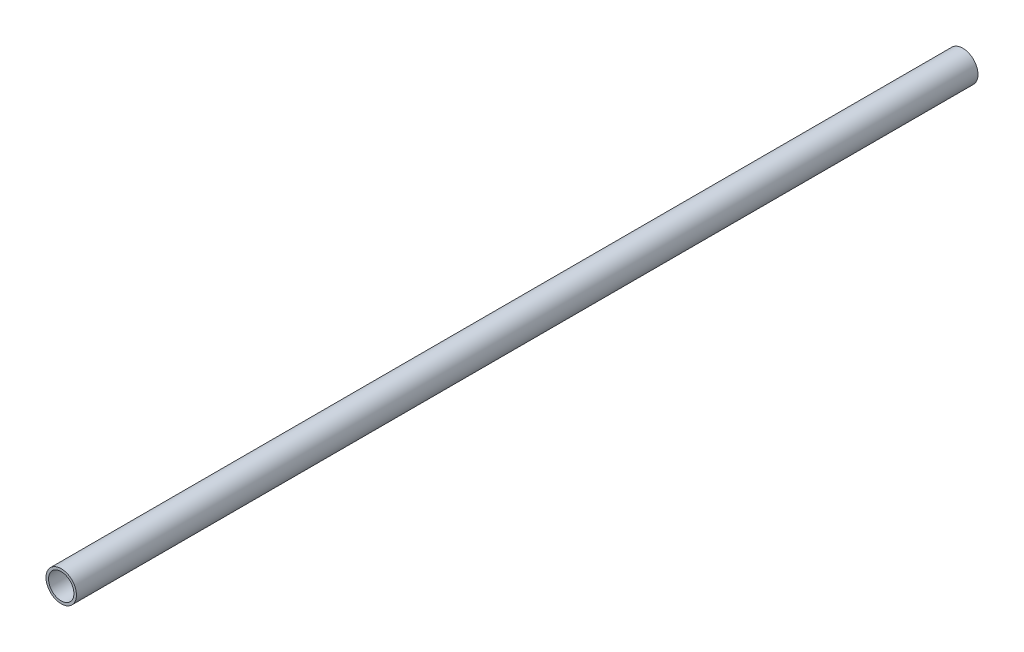
ISO-10303-21;
HEADER;
FILE_DESCRIPTION(('STEP AP214'),'2;1');
FILE_NAME('part.step','',(''),(''),'','','');
FILE_SCHEMA(('AUTOMOTIVE_DESIGN { 1 0 10303 214 1 1 1 1 }'));
ENDSEC;
DATA;
#1=APPLICATION_CONTEXT('core data for automotive mechanical design processes');
#2=APPLICATION_PROTOCOL_DEFINITION('international standard','automotive_design',2000,#1);
#3=PRODUCT_CONTEXT('',#1,'mechanical');
#4=PRODUCT('Part','Part','',(#3));
#5=PRODUCT_RELATED_PRODUCT_CATEGORY('part','',(#4));
#6=PRODUCT_DEFINITION_FORMATION('','',#4);
#7=PRODUCT_DEFINITION_CONTEXT('part definition',#1,'design');
#8=PRODUCT_DEFINITION('design','',#6,#7);
#9=PRODUCT_DEFINITION_SHAPE('','',#8);
#10=(LENGTH_UNIT() NAMED_UNIT(*) SI_UNIT(.MILLI.,.METRE.));
#11=(NAMED_UNIT(*) PLANE_ANGLE_UNIT() SI_UNIT($,.RADIAN.));
#12=(NAMED_UNIT(*) SI_UNIT($,.STERADIAN.) SOLID_ANGLE_UNIT());
#13=UNCERTAINTY_MEASURE_WITH_UNIT(LENGTH_MEASURE(1.E-05),#10,'distance_accuracy_value','');
#14=(GEOMETRIC_REPRESENTATION_CONTEXT(3) GLOBAL_UNCERTAINTY_ASSIGNED_CONTEXT((#13)) GLOBAL_UNIT_ASSIGNED_CONTEXT((#10,
#11,#12)) REPRESENTATION_CONTEXT('',''));
#15=CARTESIAN_POINT('',(0.,0.,0.));
#16=DIRECTION('',(0.,0.,1.));
#17=DIRECTION('',(1.,0.,0.));
#18=AXIS2_PLACEMENT_3D('',#15,#16,#17);
#19=CARTESIAN_POINT('',(0.,0.,1420.));
#20=DIRECTION('',(0.,0.,-1.));
#21=DIRECTION('',(-1.,0.,0.));
#22=AXIS2_PLACEMENT_3D('',#19,#20,#21);
#23=CYLINDRICAL_SURFACE('',#22,24.);
#24=CARTESIAN_POINT('',(0.,0.,1420.));
#25=DIRECTION('',(0.,0.,1.));
#26=DIRECTION('',(1.,0.,0.));
#27=AXIS2_PLACEMENT_3D('',#24,#25,#26);
#28=CIRCLE('',#27,24.);
#29=CARTESIAN_POINT('',(24.,0.,1420.));
#30=VERTEX_POINT('',#29);
#31=EDGE_CURVE('E10',#30,#30,#28,.T.);
#32=ORIENTED_EDGE('',*,*,#31,.F.);
#33=EDGE_LOOP('',(#32));
#34=FACE_BOUND('',#33,.T.);
#35=CARTESIAN_POINT('',(0.,0.,0.));
#36=DIRECTION('',(0.,0.,1.));
#37=DIRECTION('',(1.,0.,0.));
#38=AXIS2_PLACEMENT_3D('',#35,#36,#37);
#39=CIRCLE('',#38,24.);
#40=CARTESIAN_POINT('',(24.,0.,0.));
#41=VERTEX_POINT('',#40);
#42=EDGE_CURVE('E36',#41,#41,#39,.T.);
#43=ORIENTED_EDGE('',*,*,#42,.T.);
#44=EDGE_LOOP('',(#43));
#45=FACE_BOUND('',#44,.T.);
#46=ADVANCED_FACE('F33',(#34,#45),#23,.T.);
#47=CARTESIAN_POINT('',(0.,0.,1420.));
#48=DIRECTION('',(0.,0.,1.));
#49=DIRECTION('',(1.,0.,0.));
#50=AXIS2_PLACEMENT_3D('',#47,#48,#49);
#51=PLANE('',#50);
#52=CARTESIAN_POINT('',(0.,0.,1420.));
#53=DIRECTION('',(0.,0.,-1.));
#54=DIRECTION('',(-1.,0.,0.));
#55=AXIS2_PLACEMENT_3D('',#52,#53,#54);
#56=CIRCLE('',#55,20.);
#57=CARTESIAN_POINT('',(-20.,0.,1420.));
#58=VERTEX_POINT('',#57);
#59=EDGE_CURVE('E43',#58,#58,#56,.T.);
#60=ORIENTED_EDGE('',*,*,#59,.T.);
#61=EDGE_LOOP('',(#60));
#62=FACE_BOUND('',#61,.T.);
#63=ORIENTED_EDGE('',*,*,#31,.T.);
#64=EDGE_LOOP('',(#63));
#65=FACE_BOUND('',#64,.T.);
#66=ADVANCED_FACE('F51',(#62,#65),#51,.T.);
#67=CARTESIAN_POINT('',(0.,0.,0.));
#68=DIRECTION('',(0.,0.,1.));
#69=DIRECTION('',(1.,0.,0.));
#70=AXIS2_PLACEMENT_3D('',#67,#68,#69);
#71=PLANE('',#70);
#72=CARTESIAN_POINT('',(0.,0.,0.));
#73=DIRECTION('',(0.,0.,-1.));
#74=DIRECTION('',(-1.,0.,0.));
#75=AXIS2_PLACEMENT_3D('',#72,#73,#74);
#76=CIRCLE('',#75,20.);
#77=CARTESIAN_POINT('',(-20.,0.,0.));
#78=VERTEX_POINT('',#77);
#79=EDGE_CURVE('E45',#78,#78,#76,.T.);
#80=ORIENTED_EDGE('',*,*,#79,.F.);
#81=EDGE_LOOP('',(#80));
#82=FACE_BOUND('',#81,.T.);
#83=ORIENTED_EDGE('',*,*,#42,.F.);
#84=EDGE_LOOP('',(#83));
#85=FACE_BOUND('',#84,.T.);
#86=ADVANCED_FACE('F56',(#82,#85),#71,.F.);
#87=CARTESIAN_POINT('',(0.,0.,1420.));
#88=DIRECTION('',(0.,0.,-1.));
#89=DIRECTION('',(-1.,0.,0.));
#90=AXIS2_PLACEMENT_3D('',#87,#88,#89);
#91=CYLINDRICAL_SURFACE('',#90,20.);
#92=ORIENTED_EDGE('',*,*,#59,.F.);
#93=EDGE_LOOP('',(#92));
#94=FACE_BOUND('',#93,.T.);
#95=ORIENTED_EDGE('',*,*,#79,.T.);
#96=EDGE_LOOP('',(#95));
#97=FACE_BOUND('',#96,.T.);
#98=ADVANCED_FACE('F53',(#94,#97),#91,.F.);
#99=CLOSED_SHELL('',(#46,#66,#86,#98));
#100=MANIFOLD_SOLID_BREP('B2',#99);
#101=ADVANCED_BREP_SHAPE_REPRESENTATION('',(#18,#100),#14);
#102=SHAPE_DEFINITION_REPRESENTATION(#9,#101);
ENDSEC;
END-ISO-10303-21;
